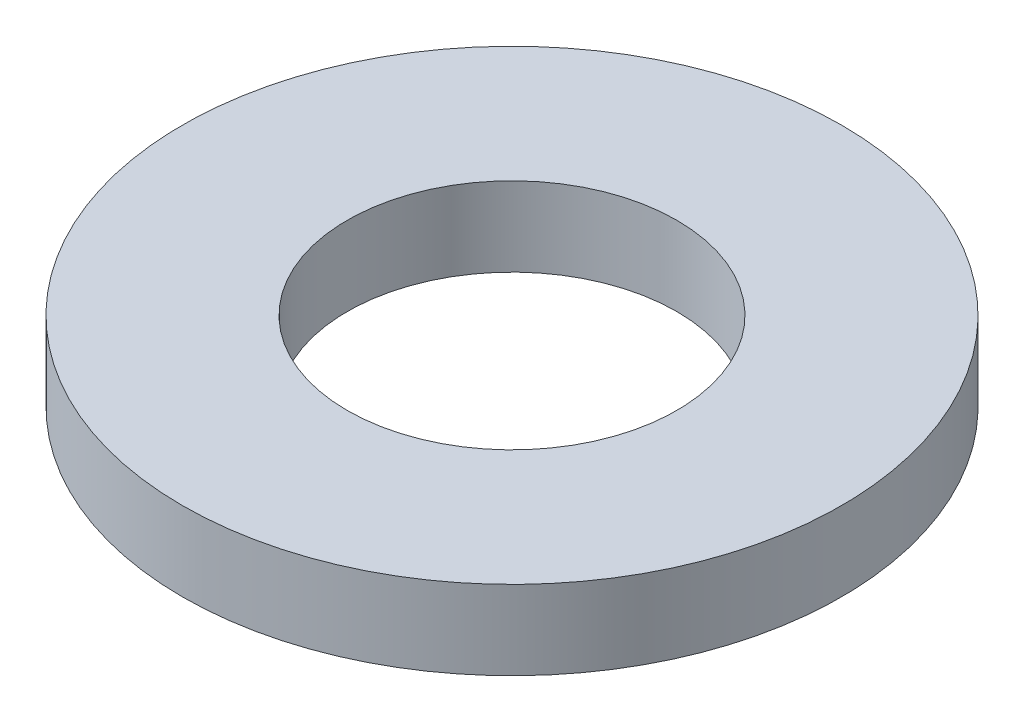
ISO-10303-21;
HEADER;
FILE_DESCRIPTION(('STEP AP214'),'2;1');
FILE_NAME('part.step','',(''),(''),'','','');
FILE_SCHEMA(('AUTOMOTIVE_DESIGN { 1 0 10303 214 1 1 1 1 }'));
ENDSEC;
DATA;
#1=APPLICATION_CONTEXT('core data for automotive mechanical design processes');
#2=APPLICATION_PROTOCOL_DEFINITION('international standard','automotive_design',2000,#1);
#3=PRODUCT_CONTEXT('',#1,'mechanical');
#4=PRODUCT('Part','Part','',(#3));
#5=PRODUCT_RELATED_PRODUCT_CATEGORY('part','',(#4));
#6=PRODUCT_DEFINITION_FORMATION('','',#4);
#7=PRODUCT_DEFINITION_CONTEXT('part definition',#1,'design');
#8=PRODUCT_DEFINITION('design','',#6,#7);
#9=PRODUCT_DEFINITION_SHAPE('','',#8);
#10=(LENGTH_UNIT() NAMED_UNIT(*) SI_UNIT(.MILLI.,.METRE.));
#11=(NAMED_UNIT(*) PLANE_ANGLE_UNIT() SI_UNIT($,.RADIAN.));
#12=(NAMED_UNIT(*) SI_UNIT($,.STERADIAN.) SOLID_ANGLE_UNIT());
#13=UNCERTAINTY_MEASURE_WITH_UNIT(LENGTH_MEASURE(1.E-05),#10,'distance_accuracy_value','');
#14=(GEOMETRIC_REPRESENTATION_CONTEXT(3) GLOBAL_UNCERTAINTY_ASSIGNED_CONTEXT((#13)) GLOBAL_UNIT_ASSIGNED_CONTEXT((#10,
#11,#12)) REPRESENTATION_CONTEXT('',''));
#15=CARTESIAN_POINT('',(0.,0.,0.));
#16=DIRECTION('',(0.,0.,1.));
#17=DIRECTION('',(1.,0.,0.));
#18=AXIS2_PLACEMENT_3D('',#15,#16,#17);
#19=CARTESIAN_POINT('',(0.,6.,0.));
#20=DIRECTION('',(0.,-1.,0.));
#21=DIRECTION('',(0.,0.,-1.));
#22=AXIS2_PLACEMENT_3D('',#19,#20,#21);
#23=CYLINDRICAL_SURFACE('',#22,25.);
#24=CARTESIAN_POINT('',(0.,6.,0.));
#25=DIRECTION('',(0.,1.,0.));
#26=DIRECTION('',(0.,0.,1.));
#27=AXIS2_PLACEMENT_3D('',#24,#25,#26);
#28=CIRCLE('',#27,25.);
#29=CARTESIAN_POINT('',(0.,6.,25.));
#30=VERTEX_POINT('',#29);
#31=EDGE_CURVE('E10',#30,#30,#28,.T.);
#32=ORIENTED_EDGE('',*,*,#31,.F.);
#33=EDGE_LOOP('',(#32));
#34=FACE_BOUND('',#33,.T.);
#35=CARTESIAN_POINT('',(0.,0.,0.));
#36=DIRECTION('',(0.,1.,0.));
#37=DIRECTION('',(0.,0.,1.));
#38=AXIS2_PLACEMENT_3D('',#35,#36,#37);
#39=CIRCLE('',#38,25.);
#40=CARTESIAN_POINT('',(0.,0.,25.));
#41=VERTEX_POINT('',#40);
#42=EDGE_CURVE('E37',#41,#41,#39,.T.);
#43=ORIENTED_EDGE('',*,*,#42,.T.);
#44=EDGE_LOOP('',(#43));
#45=FACE_BOUND('',#44,.T.);
#46=ADVANCED_FACE('F40',(#34,#45),#23,.T.);
#47=CARTESIAN_POINT('',(0.,6.,0.));
#48=DIRECTION('',(0.,1.,0.));
#49=DIRECTION('',(0.,0.,1.));
#50=AXIS2_PLACEMENT_3D('',#47,#48,#49);
#51=PLANE('',#50);
#52=CARTESIAN_POINT('',(0.,6.,0.));
#53=DIRECTION('',(0.,1.,0.));
#54=DIRECTION('',(0.,0.,1.));
#55=AXIS2_PLACEMENT_3D('',#52,#53,#54);
#56=CIRCLE('',#55,12.5);
#57=CARTESIAN_POINT('',(0.,6.,12.5));
#58=VERTEX_POINT('',#57);
#59=EDGE_CURVE('E50',#58,#58,#56,.T.);
#60=ORIENTED_EDGE('',*,*,#59,.F.);
#61=EDGE_LOOP('',(#60));
#62=FACE_BOUND('',#61,.T.);
#63=ORIENTED_EDGE('',*,*,#31,.T.);
#64=EDGE_LOOP('',(#63));
#65=FACE_BOUND('',#64,.T.);
#66=ADVANCED_FACE('F59',(#62,#65),#51,.T.);
#67=CARTESIAN_POINT('',(0.,0.,0.));
#68=DIRECTION('',(0.,1.,0.));
#69=DIRECTION('',(0.,0.,1.));
#70=AXIS2_PLACEMENT_3D('',#67,#68,#69);
#71=PLANE('',#70);
#72=CARTESIAN_POINT('',(0.,0.,0.));
#73=DIRECTION('',(0.,1.,0.));
#74=DIRECTION('',(0.,0.,1.));
#75=AXIS2_PLACEMENT_3D('',#72,#73,#74);
#76=CIRCLE('',#75,12.5);
#77=CARTESIAN_POINT('',(0.,0.,12.5));
#78=VERTEX_POINT('',#77);
#79=EDGE_CURVE('E47',#78,#78,#76,.T.);
#80=ORIENTED_EDGE('',*,*,#79,.T.);
#81=EDGE_LOOP('',(#80));
#82=FACE_BOUND('',#81,.T.);
#83=ORIENTED_EDGE('',*,*,#42,.F.);
#84=EDGE_LOOP('',(#83));
#85=FACE_BOUND('',#84,.T.);
#86=ADVANCED_FACE('F58',(#82,#85),#71,.F.);
#87=CARTESIAN_POINT('',(0.,6.,0.));
#88=DIRECTION('',(0.,-1.,0.));
#89=DIRECTION('',(0.,0.,-1.));
#90=AXIS2_PLACEMENT_3D('',#87,#88,#89);
#91=CYLINDRICAL_SURFACE('',#90,12.5);
#92=ORIENTED_EDGE('',*,*,#59,.T.);
#93=EDGE_LOOP('',(#92));
#94=FACE_BOUND('',#93,.T.);
#95=ORIENTED_EDGE('',*,*,#79,.F.);
#96=EDGE_LOOP('',(#95));
#97=FACE_BOUND('',#96,.T.);
#98=ADVANCED_FACE('F54',(#94,#97),#91,.F.);
#99=CLOSED_SHELL('',(#46,#66,#86,#98));
#100=MANIFOLD_SOLID_BREP('B2',#99);
#101=ADVANCED_BREP_SHAPE_REPRESENTATION('',(#18,#100),#14);
#102=SHAPE_DEFINITION_REPRESENTATION(#9,#101);
ENDSEC;
END-ISO-10303-21;
